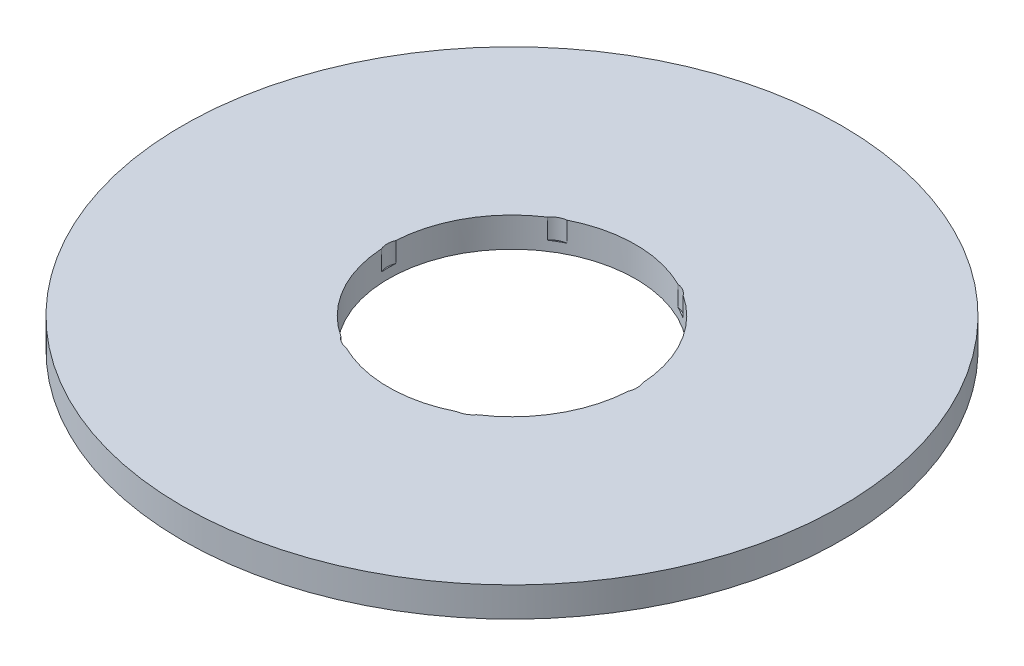
ISO-10303-21;
HEADER;
FILE_DESCRIPTION(('STEP AP214'),'2;1');
FILE_NAME('part.step','',(''),(''),'','','');
FILE_SCHEMA(('AUTOMOTIVE_DESIGN { 1 0 10303 214 1 1 1 1 }'));
ENDSEC;
DATA;
#1=APPLICATION_CONTEXT('core data for automotive mechanical design processes');
#2=APPLICATION_PROTOCOL_DEFINITION('international standard','automotive_design',2000,#1);
#3=PRODUCT_CONTEXT('',#1,'mechanical');
#4=PRODUCT('Part','Part','',(#3));
#5=PRODUCT_RELATED_PRODUCT_CATEGORY('part','',(#4));
#6=PRODUCT_DEFINITION_FORMATION('','',#4);
#7=PRODUCT_DEFINITION_CONTEXT('part definition',#1,'design');
#8=PRODUCT_DEFINITION('design','',#6,#7);
#9=PRODUCT_DEFINITION_SHAPE('','',#8);
#10=(LENGTH_UNIT() NAMED_UNIT(*) SI_UNIT(.MILLI.,.METRE.));
#11=(NAMED_UNIT(*) PLANE_ANGLE_UNIT() SI_UNIT($,.RADIAN.));
#12=(NAMED_UNIT(*) SI_UNIT($,.STERADIAN.) SOLID_ANGLE_UNIT());
#13=UNCERTAINTY_MEASURE_WITH_UNIT(LENGTH_MEASURE(1.E-05),#10,'distance_accuracy_value','');
#14=(GEOMETRIC_REPRESENTATION_CONTEXT(3) GLOBAL_UNCERTAINTY_ASSIGNED_CONTEXT((#13)) GLOBAL_UNIT_ASSIGNED_CONTEXT((#10,
#11,#12)) REPRESENTATION_CONTEXT('',''));
#15=CARTESIAN_POINT('',(0.,0.,0.));
#16=DIRECTION('',(0.,0.,1.));
#17=DIRECTION('',(1.,0.,0.));
#18=AXIS2_PLACEMENT_3D('',#15,#16,#17);
#19=CARTESIAN_POINT('',(0.,9.,0.));
#20=DIRECTION('',(0.,-1.,0.));
#21=DIRECTION('',(0.,0.,-1.));
#22=AXIS2_PLACEMENT_3D('',#19,#20,#21);
#23=CYLINDRICAL_SURFACE('',#22,100.);
#24=CARTESIAN_POINT('',(0.,9.,0.));
#25=DIRECTION('',(0.,1.,0.));
#26=DIRECTION('',(0.,0.,1.));
#27=AXIS2_PLACEMENT_3D('',#24,#25,#26);
#28=CIRCLE('',#27,100.);
#29=CARTESIAN_POINT('',(0.,9.,100.));
#30=VERTEX_POINT('',#29);
#31=EDGE_CURVE('E162',#30,#30,#28,.T.);
#32=ORIENTED_EDGE('',*,*,#31,.F.);
#33=EDGE_LOOP('',(#32));
#34=FACE_BOUND('',#33,.T.);
#35=CARTESIAN_POINT('',(0.,0.,0.));
#36=DIRECTION('',(0.,1.,0.));
#37=DIRECTION('',(0.,0.,1.));
#38=AXIS2_PLACEMENT_3D('',#35,#36,#37);
#39=CIRCLE('',#38,100.);
#40=CARTESIAN_POINT('',(0.,0.,100.));
#41=VERTEX_POINT('',#40);
#42=EDGE_CURVE('E157',#41,#41,#39,.T.);
#43=ORIENTED_EDGE('',*,*,#42,.T.);
#44=EDGE_LOOP('',(#43));
#45=FACE_BOUND('',#44,.T.);
#46=ADVANCED_FACE('F39',(#34,#45),#23,.T.);
#47=CARTESIAN_POINT('',(0.,9.,0.));
#48=DIRECTION('',(0.,1.,0.));
#49=DIRECTION('',(0.,0.,1.));
#50=AXIS2_PLACEMENT_3D('',#47,#48,#49);
#51=PLANE('',#50);
#52=CARTESIAN_POINT('',(-16.1031996550303,9.,-27.8915599669374));
#53=DIRECTION('',(0.,1.,0.));
#54=DIRECTION('',(-0.866025403784433,0.,0.50000000000001));
#55=AXIS2_PLACEMENT_3D('',#52,#53,#54);
#56=CIRCLE('',#55,5.66830993691036);
#57=CARTESIAN_POINT('',(-16.8249839824757,9.,-33.5137272470466));
#58=VERTEX_POINT('',#57);
#59=CARTESIAN_POINT('',(-20.6112471802079,9.,-31.3277271706131));
#60=VERTEX_POINT('',#59);
#61=EDGE_CURVE('E218',#58,#60,#56,.T.);
#62=ORIENTED_EDGE('',*,*,#61,.F.);
#63=CARTESIAN_POINT('',(0.,9.,0.));
#64=DIRECTION('',(0.,1.,0.));
#65=DIRECTION('',(0.,0.,1.));
#66=AXIS2_PLACEMENT_3D('',#63,#64,#65);
#67=CIRCLE('',#66,37.5);
#68=CARTESIAN_POINT('',(16.824983982475,9.,-33.513727247047));
#69=VERTEX_POINT('',#68);
#70=EDGE_CURVE('E169',#69,#58,#67,.T.);
#71=ORIENTED_EDGE('',*,*,#70,.F.);
#72=CARTESIAN_POINT('',(16.1031996550297,9.,-27.8915599669377));
#73=DIRECTION('',(0.,1.,0.));
#74=DIRECTION('',(-0.866025403784443,0.,-0.499999999999992));
#75=AXIS2_PLACEMENT_3D('',#72,#73,#74);
#76=CIRCLE('',#75,5.66830993691036);
#77=CARTESIAN_POINT('',(20.6112471802073,9.,-31.3277271706135));
#78=VERTEX_POINT('',#77);
#79=EDGE_CURVE('E285',#78,#69,#76,.T.);
#80=ORIENTED_EDGE('',*,*,#79,.F.);
#81=CARTESIAN_POINT('',(37.4362311626829,9.,-2.18600007643348));
#82=VERTEX_POINT('',#81);
#83=EDGE_CURVE('E174',#82,#78,#67,.T.);
#84=ORIENTED_EDGE('',*,*,#83,.F.);
#85=CARTESIAN_POINT('',(32.20639931006,9.,0.));
#86=DIRECTION('',(0.,1.,0.));
#87=DIRECTION('',(0.,0.,-1.));
#88=AXIS2_PLACEMENT_3D('',#85,#86,#87);
#89=CIRCLE('',#88,5.66830993691036);
#90=CARTESIAN_POINT('',(37.4362311626829,9.,2.18600007643348));
#91=VERTEX_POINT('',#90);
#92=EDGE_CURVE('E280',#91,#82,#89,.T.);
#93=ORIENTED_EDGE('',*,*,#92,.F.);
#94=CARTESIAN_POINT('',(20.6112471802077,9.,31.3277271706132));
#95=VERTEX_POINT('',#94);
#96=EDGE_CURVE('E164',#95,#91,#67,.T.);
#97=ORIENTED_EDGE('',*,*,#96,.F.);
#98=CARTESIAN_POINT('',(16.1031996550301,9.,27.8915599669375));
#99=DIRECTION('',(0.,1.,0.));
#100=DIRECTION('',(0.866025403784436,0.,-0.500000000000004));
#101=AXIS2_PLACEMENT_3D('',#98,#99,#100);
#102=CIRCLE('',#101,5.66830993691036);
#103=CARTESIAN_POINT('',(16.8249839824755,9.,33.5137272470467));
#104=VERTEX_POINT('',#103);
#105=EDGE_CURVE('E269',#104,#95,#102,.T.);
#106=ORIENTED_EDGE('',*,*,#105,.F.);
#107=CARTESIAN_POINT('',(-16.8249839824753,9.,33.5137272470469));
#108=VERTEX_POINT('',#107);
#109=EDGE_CURVE('E149',#108,#104,#67,.T.);
#110=ORIENTED_EDGE('',*,*,#109,.F.);
#111=CARTESIAN_POINT('',(-16.1031996550299,9.,27.8915599669376));
#112=DIRECTION('',(0.,1.,0.));
#113=DIRECTION('',(0.86602540378444,0.,0.499999999999998));
#114=AXIS2_PLACEMENT_3D('',#111,#112,#113);
#115=CIRCLE('',#114,5.66830993691036);
#116=CARTESIAN_POINT('',(-20.6112471802075,9.,31.3277271706134));
#117=VERTEX_POINT('',#116);
#118=EDGE_CURVE('E128',#117,#108,#115,.T.);
#119=ORIENTED_EDGE('',*,*,#118,.F.);
#120=CARTESIAN_POINT('',(-37.4362311626829,9.,2.18600007643348));
#121=VERTEX_POINT('',#120);
#122=EDGE_CURVE('E148',#121,#117,#67,.T.);
#123=ORIENTED_EDGE('',*,*,#122,.F.);
#124=CARTESIAN_POINT('',(-32.20639931006,9.,0.));
#125=DIRECTION('',(0.,1.,0.));
#126=DIRECTION('',(0.,0.,1.));
#127=AXIS2_PLACEMENT_3D('',#124,#125,#126);
#128=CIRCLE('',#127,5.66830993691036);
#129=CARTESIAN_POINT('',(-37.4362311626829,9.,-2.18600007643348));
#130=VERTEX_POINT('',#129);
#131=EDGE_CURVE('E179',#130,#121,#128,.T.);
#132=ORIENTED_EDGE('',*,*,#131,.F.);
#133=EDGE_CURVE('E161',#60,#130,#67,.T.);
#134=ORIENTED_EDGE('',*,*,#133,.F.);
#135=EDGE_LOOP('',(#62,#71,#80,#84,#93,#97,#106,#110,#119,#123,#132,#134));
#136=FACE_BOUND('',#135,.T.);
#137=ORIENTED_EDGE('',*,*,#31,.T.);
#138=EDGE_LOOP('',(#137));
#139=FACE_BOUND('',#138,.T.);
#140=ADVANCED_FACE('F141',(#136,#139),#51,.T.);
#141=CARTESIAN_POINT('',(0.,0.,0.));
#142=DIRECTION('',(0.,1.,0.));
#143=DIRECTION('',(0.,0.,1.));
#144=AXIS2_PLACEMENT_3D('',#141,#142,#143);
#145=PLANE('',#144);
#146=CARTESIAN_POINT('',(0.,0.,0.));
#147=DIRECTION('',(0.,1.,0.));
#148=DIRECTION('',(0.,0.,1.));
#149=AXIS2_PLACEMENT_3D('',#146,#147,#148);
#150=CIRCLE('',#149,37.5);
#151=CARTESIAN_POINT('',(0.,0.,37.5));
#152=VERTEX_POINT('',#151);
#153=EDGE_CURVE('E166',#152,#152,#150,.T.);
#154=ORIENTED_EDGE('',*,*,#153,.T.);
#155=EDGE_LOOP('',(#154));
#156=FACE_BOUND('',#155,.T.);
#157=ORIENTED_EDGE('',*,*,#42,.F.);
#158=EDGE_LOOP('',(#157));
#159=FACE_BOUND('',#158,.T.);
#160=ADVANCED_FACE('F234',(#156,#159),#145,.F.);
#161=CARTESIAN_POINT('',(0.,9.,0.));
#162=DIRECTION('',(0.,-1.,0.));
#163=DIRECTION('',(0.,0.,-1.));
#164=AXIS2_PLACEMENT_3D('',#161,#162,#163);
#165=CYLINDRICAL_SURFACE('',#164,37.5);
#166=DIRECTION('',(0.,1.,0.));
#167=VECTOR('',#166,1.);
#168=CARTESIAN_POINT('',(-16.8249839824757,5.96584891909045,-33.5137272470466));
#169=LINE('',#168,#167);
#170=CARTESIAN_POINT('',(-16.8249839824757,2.9316978381809,-33.5137272470466));
#171=VERTEX_POINT('',#170);
#172=EDGE_CURVE('E11',#171,#58,#169,.T.);
#173=ORIENTED_EDGE('',*,*,#172,.F.);
#174=CARTESIAN_POINT('',(0.,2.9316978381809,0.));
#175=DIRECTION('',(0.,1.,0.));
#176=DIRECTION('',(0.,0.,1.));
#177=AXIS2_PLACEMENT_3D('',#174,#175,#176);
#178=CIRCLE('',#177,37.5);
#179=CARTESIAN_POINT('',(-20.6112471802079,2.9316978381809,-31.3277271706131));
#180=VERTEX_POINT('',#179);
#181=EDGE_CURVE('E214',#171,#180,#178,.T.);
#182=ORIENTED_EDGE('',*,*,#181,.T.);
#183=DIRECTION('',(0.,1.,0.));
#184=VECTOR('',#183,1.);
#185=CARTESIAN_POINT('',(-20.611247180208,5.96584891909045,-31.3277271706131));
#186=LINE('',#185,#184);
#187=EDGE_CURVE('E46',#60,#180,#186,.F.);
#188=ORIENTED_EDGE('',*,*,#187,.F.);
#189=ORIENTED_EDGE('',*,*,#133,.T.);
#190=DIRECTION('',(0.,1.,0.));
#191=VECTOR('',#190,1.);
#192=CARTESIAN_POINT('',(-37.4362311626829,5.96584891909045,-2.18600007643352));
#193=LINE('',#192,#191);
#194=CARTESIAN_POINT('',(-37.4362311626829,2.9316978381809,-2.18600007643348));
#195=VERTEX_POINT('',#194);
#196=EDGE_CURVE('E187',#195,#130,#193,.T.);
#197=ORIENTED_EDGE('',*,*,#196,.F.);
#198=CARTESIAN_POINT('',(0.,2.9316978381809,0.));
#199=DIRECTION('',(0.,1.,0.));
#200=DIRECTION('',(0.,0.,1.));
#201=AXIS2_PLACEMENT_3D('',#198,#199,#200);
#202=CIRCLE('',#201,37.5);
#203=CARTESIAN_POINT('',(-37.4362311626829,2.9316978381809,2.18600007643348));
#204=VERTEX_POINT('',#203);
#205=EDGE_CURVE('E184',#195,#204,#202,.T.);
#206=ORIENTED_EDGE('',*,*,#205,.T.);
#207=DIRECTION('',(0.,1.,0.));
#208=VECTOR('',#207,1.);
#209=CARTESIAN_POINT('',(-37.4362311626829,5.96584891909045,2.18600007643352));
#210=LINE('',#209,#208);
#211=EDGE_CURVE('E158',#121,#204,#210,.F.);
#212=ORIENTED_EDGE('',*,*,#211,.F.);
#213=ORIENTED_EDGE('',*,*,#122,.T.);
#214=DIRECTION('',(0.,1.,0.));
#215=VECTOR('',#214,1.);
#216=CARTESIAN_POINT('',(-20.6112471802075,5.96584891909045,31.3277271706134));
#217=LINE('',#216,#215);
#218=CARTESIAN_POINT('',(-20.6112471802075,2.9316978381809,31.3277271706134));
#219=VERTEX_POINT('',#218);
#220=EDGE_CURVE('E127',#219,#117,#217,.T.);
#221=ORIENTED_EDGE('',*,*,#220,.F.);
#222=CARTESIAN_POINT('',(0.,2.9316978381809,0.));
#223=DIRECTION('',(0.,1.,0.));
#224=DIRECTION('',(0.,0.,1.));
#225=AXIS2_PLACEMENT_3D('',#222,#223,#224);
#226=CIRCLE('',#225,37.5);
#227=CARTESIAN_POINT('',(-16.8249839824753,2.9316978381809,33.5137272470469));
#228=VERTEX_POINT('',#227);
#229=EDGE_CURVE('E189',#219,#228,#226,.T.);
#230=ORIENTED_EDGE('',*,*,#229,.T.);
#231=DIRECTION('',(0.,1.,0.));
#232=VECTOR('',#231,1.);
#233=CARTESIAN_POINT('',(-16.8249839824752,5.96584891909045,33.5137272470469));
#234=LINE('',#233,#232);
#235=EDGE_CURVE('E140',#108,#228,#234,.F.);
#236=ORIENTED_EDGE('',*,*,#235,.F.);
#237=ORIENTED_EDGE('',*,*,#109,.T.);
#238=DIRECTION('',(0.,1.,0.));
#239=VECTOR('',#238,1.);
#240=CARTESIAN_POINT('',(16.8249839824755,5.96584891909045,33.5137272470468));
#241=LINE('',#240,#239);
#242=CARTESIAN_POINT('',(16.8249839824755,2.9316978381809,33.5137272470467));
#243=VERTEX_POINT('',#242);
#244=EDGE_CURVE('E196',#243,#104,#241,.T.);
#245=ORIENTED_EDGE('',*,*,#244,.F.);
#246=CARTESIAN_POINT('',(0.,2.9316978381809,0.));
#247=DIRECTION('',(0.,1.,0.));
#248=DIRECTION('',(0.,0.,1.));
#249=AXIS2_PLACEMENT_3D('',#246,#247,#248);
#250=CIRCLE('',#249,37.5);
#251=CARTESIAN_POINT('',(20.6112471802077,2.9316978381809,31.3277271706132));
#252=VERTEX_POINT('',#251);
#253=EDGE_CURVE('E136',#243,#252,#250,.T.);
#254=ORIENTED_EDGE('',*,*,#253,.T.);
#255=DIRECTION('',(0.,1.,0.));
#256=VECTOR('',#255,1.);
#257=CARTESIAN_POINT('',(20.6112471802078,5.96584891909045,31.3277271706132));
#258=LINE('',#257,#256);
#259=EDGE_CURVE('E194',#95,#252,#258,.F.);
#260=ORIENTED_EDGE('',*,*,#259,.F.);
#261=ORIENTED_EDGE('',*,*,#96,.T.);
#262=DIRECTION('',(0.,1.,0.));
#263=VECTOR('',#262,1.);
#264=CARTESIAN_POINT('',(37.4362311626829,5.96584891909045,2.18600007643352));
#265=LINE('',#264,#263);
#266=CARTESIAN_POINT('',(37.4362311626829,2.9316978381809,2.18600007643348));
#267=VERTEX_POINT('',#266);
#268=EDGE_CURVE('E206',#267,#91,#265,.T.);
#269=ORIENTED_EDGE('',*,*,#268,.F.);
#270=CARTESIAN_POINT('',(0.,2.9316978381809,0.));
#271=DIRECTION('',(0.,1.,0.));
#272=DIRECTION('',(0.,0.,1.));
#273=AXIS2_PLACEMENT_3D('',#270,#271,#272);
#274=CIRCLE('',#273,37.5);
#275=CARTESIAN_POINT('',(37.4362311626829,2.9316978381809,-2.18600007643348));
#276=VERTEX_POINT('',#275);
#277=EDGE_CURVE('E199',#267,#276,#274,.T.);
#278=ORIENTED_EDGE('',*,*,#277,.T.);
#279=DIRECTION('',(0.,1.,0.));
#280=VECTOR('',#279,1.);
#281=CARTESIAN_POINT('',(37.4362311626829,5.96584891909045,-2.18600007643352));
#282=LINE('',#281,#280);
#283=EDGE_CURVE('E201',#82,#276,#282,.F.);
#284=ORIENTED_EDGE('',*,*,#283,.F.);
#285=ORIENTED_EDGE('',*,*,#83,.T.);
#286=DIRECTION('',(0.,1.,0.));
#287=VECTOR('',#286,1.);
#288=CARTESIAN_POINT('',(20.6112471802073,5.96584891909045,-31.3277271706135));
#289=LINE('',#288,#287);
#290=CARTESIAN_POINT('',(20.6112471802073,2.9316978381809,-31.3277271706135));
#291=VERTEX_POINT('',#290);
#292=EDGE_CURVE('E213',#291,#78,#289,.T.);
#293=ORIENTED_EDGE('',*,*,#292,.F.);
#294=CARTESIAN_POINT('',(0.,2.9316978381809,0.));
#295=DIRECTION('',(0.,1.,0.));
#296=DIRECTION('',(0.,0.,1.));
#297=AXIS2_PLACEMENT_3D('',#294,#295,#296);
#298=CIRCLE('',#297,37.5);
#299=CARTESIAN_POINT('',(16.824983982475,2.9316978381809,-33.513727247047));
#300=VERTEX_POINT('',#299);
#301=EDGE_CURVE('E208',#291,#300,#298,.T.);
#302=ORIENTED_EDGE('',*,*,#301,.T.);
#303=DIRECTION('',(0.,1.,0.));
#304=VECTOR('',#303,1.);
#305=CARTESIAN_POINT('',(16.824983982475,5.96584891909045,-33.513727247047));
#306=LINE('',#305,#304);
#307=EDGE_CURVE('E211',#69,#300,#306,.F.);
#308=ORIENTED_EDGE('',*,*,#307,.F.);
#309=ORIENTED_EDGE('',*,*,#70,.T.);
#310=EDGE_LOOP('',(#173,#182,#188,#189,#197,#206,#212,#213,#221,#230,#236,#237,#245,#254,#260,
#261,#269,#278,#284,#285,#293,#302,#308,#309));
#311=FACE_BOUND('',#310,.T.);
#312=ORIENTED_EDGE('',*,*,#153,.F.);
#313=EDGE_LOOP('',(#312));
#314=FACE_BOUND('',#313,.T.);
#315=ADVANCED_FACE('F152',(#311,#314),#165,.F.);
#316=CARTESIAN_POINT('',(-32.20639931006,2.9316978381809,0.));
#317=DIRECTION('',(0.,1.,0.));
#318=DIRECTION('',(0.,0.,1.));
#319=AXIS2_PLACEMENT_3D('',#316,#317,#318);
#320=CYLINDRICAL_SURFACE('',#319,5.66830993691036);
#321=ORIENTED_EDGE('',*,*,#196,.T.);
#322=ORIENTED_EDGE('',*,*,#131,.T.);
#323=ORIENTED_EDGE('',*,*,#211,.T.);
#324=CARTESIAN_POINT('',(-32.20639931006,2.9316978381809,0.));
#325=DIRECTION('',(0.,1.,0.));
#326=DIRECTION('',(0.,0.,1.));
#327=AXIS2_PLACEMENT_3D('',#324,#325,#326);
#328=CIRCLE('',#327,5.66830993691036);
#329=EDGE_CURVE('E180',#195,#204,#328,.T.);
#330=ORIENTED_EDGE('',*,*,#329,.F.);
#331=EDGE_LOOP('',(#321,#322,#323,#330));
#332=FACE_BOUND('',#331,.T.);
#333=ADVANCED_FACE('F244',(#332),#320,.F.);
#334=CARTESIAN_POINT('',(-32.20639931006,2.9316978381809,0.));
#335=DIRECTION('',(0.,1.,0.));
#336=DIRECTION('',(0.,0.,1.));
#337=AXIS2_PLACEMENT_3D('',#334,#335,#336);
#338=PLANE('',#337);
#339=ORIENTED_EDGE('',*,*,#329,.T.);
#340=ORIENTED_EDGE('',*,*,#205,.F.);
#341=EDGE_LOOP('',(#339,#340));
#342=FACE_BOUND('',#341,.T.);
#343=ADVANCED_FACE('F248',(#342),#338,.T.);
#344=CARTESIAN_POINT('',(-16.1031996550299,2.9316978381809,27.8915599669376));
#345=DIRECTION('',(0.,1.,0.));
#346=DIRECTION('',(0.,0.,1.));
#347=AXIS2_PLACEMENT_3D('',#344,#345,#346);
#348=CYLINDRICAL_SURFACE('',#347,5.66830993691036);
#349=ORIENTED_EDGE('',*,*,#220,.T.);
#350=ORIENTED_EDGE('',*,*,#118,.T.);
#351=ORIENTED_EDGE('',*,*,#235,.T.);
#352=CARTESIAN_POINT('',(-16.1031996550299,2.9316978381809,27.8915599669376));
#353=DIRECTION('',(0.,1.,0.));
#354=DIRECTION('',(0.86602540378444,0.,0.499999999999998));
#355=AXIS2_PLACEMENT_3D('',#352,#353,#354);
#356=CIRCLE('',#355,5.66830993691036);
#357=EDGE_CURVE('E135',#219,#228,#356,.T.);
#358=ORIENTED_EDGE('',*,*,#357,.F.);
#359=EDGE_LOOP('',(#349,#350,#351,#358));
#360=FACE_BOUND('',#359,.T.);
#361=ADVANCED_FACE('F126',(#360),#348,.F.);
#362=CARTESIAN_POINT('',(-16.1031996550299,2.9316978381809,27.8915599669376));
#363=DIRECTION('',(0.,1.,0.));
#364=DIRECTION('',(0.86602540378444,0.,0.499999999999998));
#365=AXIS2_PLACEMENT_3D('',#362,#363,#364);
#366=PLANE('',#365);
#367=ORIENTED_EDGE('',*,*,#357,.T.);
#368=ORIENTED_EDGE('',*,*,#229,.F.);
#369=EDGE_LOOP('',(#367,#368));
#370=FACE_BOUND('',#369,.T.);
#371=ADVANCED_FACE('F258',(#370),#366,.T.);
#372=CARTESIAN_POINT('',(16.1031996550301,2.9316978381809,27.8915599669375));
#373=DIRECTION('',(0.,1.,0.));
#374=DIRECTION('',(0.,0.,1.));
#375=AXIS2_PLACEMENT_3D('',#372,#373,#374);
#376=CYLINDRICAL_SURFACE('',#375,5.66830993691036);
#377=ORIENTED_EDGE('',*,*,#244,.T.);
#378=ORIENTED_EDGE('',*,*,#105,.T.);
#379=ORIENTED_EDGE('',*,*,#259,.T.);
#380=CARTESIAN_POINT('',(16.1031996550301,2.9316978381809,27.8915599669375));
#381=DIRECTION('',(0.,1.,0.));
#382=DIRECTION('',(0.866025403784436,0.,-0.500000000000004));
#383=AXIS2_PLACEMENT_3D('',#380,#381,#382);
#384=CIRCLE('',#383,5.66830993691036);
#385=EDGE_CURVE('E147',#243,#252,#384,.T.);
#386=ORIENTED_EDGE('',*,*,#385,.F.);
#387=EDGE_LOOP('',(#377,#378,#379,#386));
#388=FACE_BOUND('',#387,.T.);
#389=ADVANCED_FACE('F256',(#388),#376,.F.);
#390=CARTESIAN_POINT('',(16.1031996550301,2.9316978381809,27.8915599669375));
#391=DIRECTION('',(0.,1.,0.));
#392=DIRECTION('',(0.866025403784436,0.,-0.500000000000004));
#393=AXIS2_PLACEMENT_3D('',#390,#391,#392);
#394=PLANE('',#393);
#395=ORIENTED_EDGE('',*,*,#385,.T.);
#396=ORIENTED_EDGE('',*,*,#253,.F.);
#397=EDGE_LOOP('',(#395,#396));
#398=FACE_BOUND('',#397,.T.);
#399=ADVANCED_FACE('F263',(#398),#394,.T.);
#400=CARTESIAN_POINT('',(32.20639931006,2.9316978381809,0.));
#401=DIRECTION('',(0.,1.,0.));
#402=DIRECTION('',(0.,0.,1.));
#403=AXIS2_PLACEMENT_3D('',#400,#401,#402);
#404=CYLINDRICAL_SURFACE('',#403,5.66830993691036);
#405=ORIENTED_EDGE('',*,*,#268,.T.);
#406=ORIENTED_EDGE('',*,*,#92,.T.);
#407=ORIENTED_EDGE('',*,*,#283,.T.);
#408=CARTESIAN_POINT('',(32.20639931006,2.9316978381809,0.));
#409=DIRECTION('',(0.,1.,0.));
#410=DIRECTION('',(0.,0.,-1.));
#411=AXIS2_PLACEMENT_3D('',#408,#409,#410);
#412=CIRCLE('',#411,5.66830993691036);
#413=EDGE_CURVE('E273',#267,#276,#412,.T.);
#414=ORIENTED_EDGE('',*,*,#413,.F.);
#415=EDGE_LOOP('',(#405,#406,#407,#414));
#416=FACE_BOUND('',#415,.T.);
#417=ADVANCED_FACE('F297',(#416),#404,.F.);
#418=CARTESIAN_POINT('',(32.20639931006,2.9316978381809,0.));
#419=DIRECTION('',(0.,1.,0.));
#420=DIRECTION('',(0.,0.,-1.));
#421=AXIS2_PLACEMENT_3D('',#418,#419,#420);
#422=PLANE('',#421);
#423=ORIENTED_EDGE('',*,*,#413,.T.);
#424=ORIENTED_EDGE('',*,*,#277,.F.);
#425=EDGE_LOOP('',(#423,#424));
#426=FACE_BOUND('',#425,.T.);
#427=ADVANCED_FACE('F299',(#426),#422,.T.);
#428=CARTESIAN_POINT('',(16.1031996550297,2.9316978381809,-27.8915599669377));
#429=DIRECTION('',(0.,1.,0.));
#430=DIRECTION('',(0.,0.,1.));
#431=AXIS2_PLACEMENT_3D('',#428,#429,#430);
#432=CYLINDRICAL_SURFACE('',#431,5.66830993691036);
#433=ORIENTED_EDGE('',*,*,#292,.T.);
#434=ORIENTED_EDGE('',*,*,#79,.T.);
#435=ORIENTED_EDGE('',*,*,#307,.T.);
#436=CARTESIAN_POINT('',(16.1031996550297,2.9316978381809,-27.8915599669377));
#437=DIRECTION('',(0.,1.,0.));
#438=DIRECTION('',(-0.866025403784443,0.,-0.499999999999992));
#439=AXIS2_PLACEMENT_3D('',#436,#437,#438);
#440=CIRCLE('',#439,5.66830993691036);
#441=EDGE_CURVE('E56',#291,#300,#440,.T.);
#442=ORIENTED_EDGE('',*,*,#441,.F.);
#443=EDGE_LOOP('',(#433,#434,#435,#442));
#444=FACE_BOUND('',#443,.T.);
#445=ADVANCED_FACE('F292',(#444),#432,.F.);
#446=CARTESIAN_POINT('',(16.1031996550297,2.9316978381809,-27.8915599669377));
#447=DIRECTION('',(0.,1.,0.));
#448=DIRECTION('',(-0.866025403784443,0.,-0.499999999999992));
#449=AXIS2_PLACEMENT_3D('',#446,#447,#448);
#450=PLANE('',#449);
#451=ORIENTED_EDGE('',*,*,#441,.T.);
#452=ORIENTED_EDGE('',*,*,#301,.F.);
#453=EDGE_LOOP('',(#451,#452));
#454=FACE_BOUND('',#453,.T.);
#455=ADVANCED_FACE('F226',(#454),#450,.T.);
#456=CARTESIAN_POINT('',(-16.1031996550303,2.9316978381809,-27.8915599669374));
#457=DIRECTION('',(0.,1.,0.));
#458=DIRECTION('',(0.,0.,1.));
#459=AXIS2_PLACEMENT_3D('',#456,#457,#458);
#460=CYLINDRICAL_SURFACE('',#459,5.66830993691036);
#461=ORIENTED_EDGE('',*,*,#172,.T.);
#462=ORIENTED_EDGE('',*,*,#61,.T.);
#463=ORIENTED_EDGE('',*,*,#187,.T.);
#464=CARTESIAN_POINT('',(-16.1031996550303,2.9316978381809,-27.8915599669374));
#465=DIRECTION('',(0.,1.,0.));
#466=DIRECTION('',(-0.866025403784433,0.,0.50000000000001));
#467=AXIS2_PLACEMENT_3D('',#464,#465,#466);
#468=CIRCLE('',#467,5.66830993691036);
#469=EDGE_CURVE('E55',#171,#180,#468,.T.);
#470=ORIENTED_EDGE('',*,*,#469,.F.);
#471=EDGE_LOOP('',(#461,#462,#463,#470));
#472=FACE_BOUND('',#471,.T.);
#473=ADVANCED_FACE('F217',(#472),#460,.F.);
#474=CARTESIAN_POINT('',(-16.1031996550303,2.9316978381809,-27.8915599669374));
#475=DIRECTION('',(0.,1.,0.));
#476=DIRECTION('',(-0.866025403784433,0.,0.50000000000001));
#477=AXIS2_PLACEMENT_3D('',#474,#475,#476);
#478=PLANE('',#477);
#479=ORIENTED_EDGE('',*,*,#469,.T.);
#480=ORIENTED_EDGE('',*,*,#181,.F.);
#481=EDGE_LOOP('',(#479,#480));
#482=FACE_BOUND('',#481,.T.);
#483=ADVANCED_FACE('F219',(#482),#478,.T.);
#484=CLOSED_SHELL('',(#46,#140,#160,#315,#333,#343,#361,#371,#389,#399,#417,#427,#445,#455,#473,#483));
#485=MANIFOLD_SOLID_BREP('B2',#484);
#486=ADVANCED_BREP_SHAPE_REPRESENTATION('',(#18,#485),#14);
#487=SHAPE_DEFINITION_REPRESENTATION(#9,#486);
ENDSEC;
END-ISO-10303-21;
